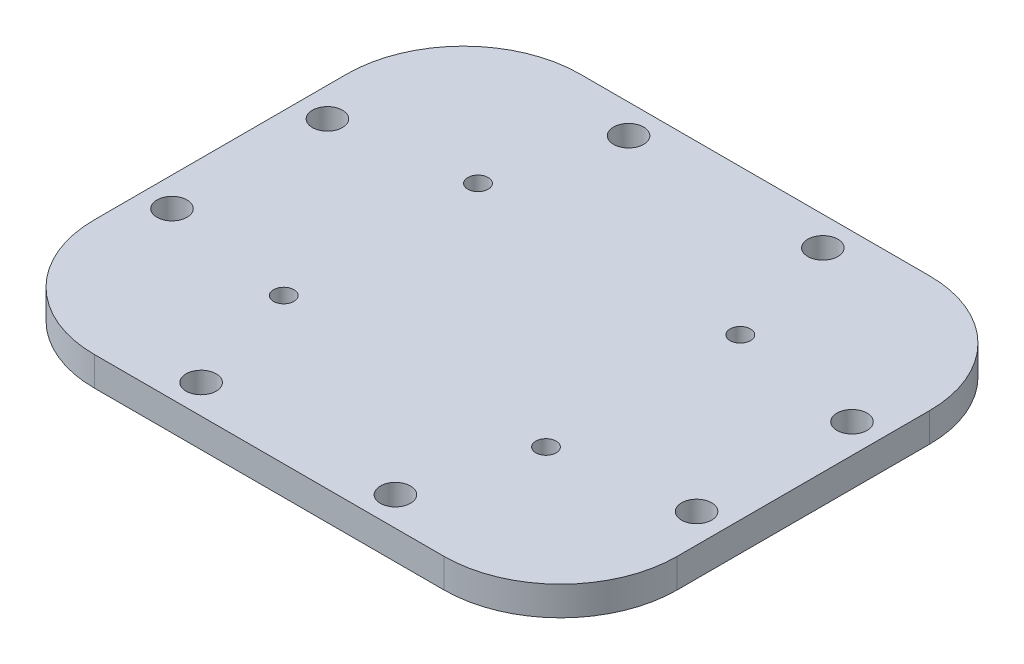
ISO-10303-21;
HEADER;
FILE_DESCRIPTION(('STEP AP214'),'2;1');
FILE_NAME('part.step','',(''),(''),'','','');
FILE_SCHEMA(('AUTOMOTIVE_DESIGN { 1 0 10303 214 1 1 1 1 }'));
ENDSEC;
DATA;
#1=APPLICATION_CONTEXT('core data for automotive mechanical design processes');
#2=APPLICATION_PROTOCOL_DEFINITION('international standard','automotive_design',2000,#1);
#3=PRODUCT_CONTEXT('',#1,'mechanical');
#4=PRODUCT('Part','Part','',(#3));
#5=PRODUCT_RELATED_PRODUCT_CATEGORY('part','',(#4));
#6=PRODUCT_DEFINITION_FORMATION('','',#4);
#7=PRODUCT_DEFINITION_CONTEXT('part definition',#1,'design');
#8=PRODUCT_DEFINITION('design','',#6,#7);
#9=PRODUCT_DEFINITION_SHAPE('','',#8);
#10=(LENGTH_UNIT() NAMED_UNIT(*) SI_UNIT(.MILLI.,.METRE.));
#11=(NAMED_UNIT(*) PLANE_ANGLE_UNIT() SI_UNIT($,.RADIAN.));
#12=(NAMED_UNIT(*) SI_UNIT($,.STERADIAN.) SOLID_ANGLE_UNIT());
#13=UNCERTAINTY_MEASURE_WITH_UNIT(LENGTH_MEASURE(1.E-05),#10,'distance_accuracy_value','');
#14=(GEOMETRIC_REPRESENTATION_CONTEXT(3) GLOBAL_UNCERTAINTY_ASSIGNED_CONTEXT((#13)) GLOBAL_UNIT_ASSIGNED_CONTEXT((#10,
#11,#12)) REPRESENTATION_CONTEXT('',''));
#15=CARTESIAN_POINT('',(0.,0.,0.));
#16=DIRECTION('',(0.,0.,1.));
#17=DIRECTION('',(1.,0.,0.));
#18=AXIS2_PLACEMENT_3D('',#15,#16,#17);
#19=CARTESIAN_POINT('',(30.,3.,-25.));
#20=DIRECTION('',(-1.,0.,0.));
#21=DIRECTION('',(0.,0.,1.));
#22=AXIS2_PLACEMENT_3D('',#19,#20,#21);
#23=PLANE('',#22);
#24=DIRECTION('',(0.,0.,-1.));
#25=VECTOR('',#24,1.);
#26=CARTESIAN_POINT('',(30.,3.,-25.));
#27=LINE('',#26,#25);
#28=CARTESIAN_POINT('',(30.,3.,13.));
#29=VERTEX_POINT('',#28);
#30=CARTESIAN_POINT('',(30.,3.,-13.));
#31=VERTEX_POINT('',#30);
#32=EDGE_CURVE('E124',#29,#31,#27,.T.);
#33=ORIENTED_EDGE('',*,*,#32,.F.);
#34=DIRECTION('',(0.,-1.,0.));
#35=VECTOR('',#34,1.);
#36=CARTESIAN_POINT('',(30.,3.,13.));
#37=LINE('',#36,#35);
#38=CARTESIAN_POINT('',(30.,0.,13.));
#39=VERTEX_POINT('',#38);
#40=EDGE_CURVE('E109',#29,#39,#37,.T.);
#41=ORIENTED_EDGE('',*,*,#40,.T.);
#42=DIRECTION('',(0.,0.,-1.));
#43=VECTOR('',#42,1.);
#44=CARTESIAN_POINT('',(30.,0.,-25.));
#45=LINE('',#44,#43);
#46=CARTESIAN_POINT('',(30.,0.,-13.));
#47=VERTEX_POINT('',#46);
#48=EDGE_CURVE('E121',#39,#47,#45,.T.);
#49=ORIENTED_EDGE('',*,*,#48,.T.);
#50=DIRECTION('',(0.,-1.,0.));
#51=VECTOR('',#50,1.);
#52=CARTESIAN_POINT('',(30.,3.,-13.));
#53=LINE('',#52,#51);
#54=EDGE_CURVE('E126',#47,#31,#53,.F.);
#55=ORIENTED_EDGE('',*,*,#54,.T.);
#56=EDGE_LOOP('',(#33,#41,#49,#55));
#57=FACE_BOUND('',#56,.T.);
#58=ADVANCED_FACE('F39',(#57),#23,.F.);
#59=CARTESIAN_POINT('',(-30.,3.,-25.));
#60=DIRECTION('',(0.,0.,1.));
#61=DIRECTION('',(1.,0.,0.));
#62=AXIS2_PLACEMENT_3D('',#59,#60,#61);
#63=PLANE('',#62);
#64=DIRECTION('',(-1.,0.,0.));
#65=VECTOR('',#64,1.);
#66=CARTESIAN_POINT('',(-30.,0.,-25.));
#67=LINE('',#66,#65);
#68=CARTESIAN_POINT('',(18.,0.,-25.));
#69=VERTEX_POINT('',#68);
#70=CARTESIAN_POINT('',(-18.,0.,-25.));
#71=VERTEX_POINT('',#70);
#72=EDGE_CURVE('E131',#69,#71,#67,.T.);
#73=ORIENTED_EDGE('',*,*,#72,.T.);
#74=DIRECTION('',(0.,-1.,0.));
#75=VECTOR('',#74,1.);
#76=CARTESIAN_POINT('',(-18.,3.,-25.));
#77=LINE('',#76,#75);
#78=CARTESIAN_POINT('',(-18.,3.,-25.));
#79=VERTEX_POINT('',#78);
#80=EDGE_CURVE('E12',#71,#79,#77,.F.);
#81=ORIENTED_EDGE('',*,*,#80,.T.);
#82=DIRECTION('',(-1.,0.,0.));
#83=VECTOR('',#82,1.);
#84=CARTESIAN_POINT('',(-30.,3.,-25.));
#85=LINE('',#84,#83);
#86=CARTESIAN_POINT('',(18.,3.,-25.));
#87=VERTEX_POINT('',#86);
#88=EDGE_CURVE('E194',#87,#79,#85,.T.);
#89=ORIENTED_EDGE('',*,*,#88,.F.);
#90=DIRECTION('',(0.,-1.,0.));
#91=VECTOR('',#90,1.);
#92=CARTESIAN_POINT('',(18.,3.,-25.));
#93=LINE('',#92,#91);
#94=EDGE_CURVE('E47',#87,#69,#93,.T.);
#95=ORIENTED_EDGE('',*,*,#94,.T.);
#96=EDGE_LOOP('',(#73,#81,#89,#95));
#97=FACE_BOUND('',#96,.T.);
#98=ADVANCED_FACE('F192',(#97),#63,.F.);
#99=CARTESIAN_POINT('',(-30.,3.,-25.));
#100=DIRECTION('',(1.,0.,0.));
#101=DIRECTION('',(0.,0.,-1.));
#102=AXIS2_PLACEMENT_3D('',#99,#100,#101);
#103=PLANE('',#102);
#104=DIRECTION('',(0.,0.,1.));
#105=VECTOR('',#104,1.);
#106=CARTESIAN_POINT('',(-30.,3.,-25.));
#107=LINE('',#106,#105);
#108=CARTESIAN_POINT('',(-30.,3.,-13.));
#109=VERTEX_POINT('',#108);
#110=CARTESIAN_POINT('',(-30.,3.,13.));
#111=VERTEX_POINT('',#110);
#112=EDGE_CURVE('E202',#109,#111,#107,.T.);
#113=ORIENTED_EDGE('',*,*,#112,.F.);
#114=DIRECTION('',(0.,-1.,0.));
#115=VECTOR('',#114,1.);
#116=CARTESIAN_POINT('',(-30.,3.,-13.));
#117=LINE('',#116,#115);
#118=CARTESIAN_POINT('',(-30.,0.,-13.));
#119=VERTEX_POINT('',#118);
#120=EDGE_CURVE('E186',#109,#119,#117,.T.);
#121=ORIENTED_EDGE('',*,*,#120,.T.);
#122=DIRECTION('',(0.,0.,1.));
#123=VECTOR('',#122,1.);
#124=CARTESIAN_POINT('',(-30.,0.,-25.));
#125=LINE('',#124,#123);
#126=CARTESIAN_POINT('',(-30.,0.,13.));
#127=VERTEX_POINT('',#126);
#128=EDGE_CURVE('E135',#119,#127,#125,.T.);
#129=ORIENTED_EDGE('',*,*,#128,.T.);
#130=DIRECTION('',(0.,-1.,0.));
#131=VECTOR('',#130,1.);
#132=CARTESIAN_POINT('',(-30.,3.,13.));
#133=LINE('',#132,#131);
#134=EDGE_CURVE('E54',#127,#111,#133,.F.);
#135=ORIENTED_EDGE('',*,*,#134,.T.);
#136=EDGE_LOOP('',(#113,#121,#129,#135));
#137=FACE_BOUND('',#136,.T.);
#138=ADVANCED_FACE('F201',(#137),#103,.F.);
#139=CARTESIAN_POINT('',(-30.,3.,25.));
#140=DIRECTION('',(0.,0.,-1.));
#141=DIRECTION('',(-1.,0.,0.));
#142=AXIS2_PLACEMENT_3D('',#139,#140,#141);
#143=PLANE('',#142);
#144=DIRECTION('',(1.,0.,0.));
#145=VECTOR('',#144,1.);
#146=CARTESIAN_POINT('',(-30.,0.,25.));
#147=LINE('',#146,#145);
#148=CARTESIAN_POINT('',(-18.,0.,25.));
#149=VERTEX_POINT('',#148);
#150=CARTESIAN_POINT('',(18.,0.,25.));
#151=VERTEX_POINT('',#150);
#152=EDGE_CURVE('E151',#149,#151,#147,.T.);
#153=ORIENTED_EDGE('',*,*,#152,.T.);
#154=DIRECTION('',(0.,-1.,0.));
#155=VECTOR('',#154,1.);
#156=CARTESIAN_POINT('',(18.,3.,25.));
#157=LINE('',#156,#155);
#158=CARTESIAN_POINT('',(18.,3.,25.));
#159=VERTEX_POINT('',#158);
#160=EDGE_CURVE('E110',#151,#159,#157,.F.);
#161=ORIENTED_EDGE('',*,*,#160,.T.);
#162=DIRECTION('',(1.,0.,0.));
#163=VECTOR('',#162,1.);
#164=CARTESIAN_POINT('',(-30.,3.,25.));
#165=LINE('',#164,#163);
#166=CARTESIAN_POINT('',(-18.,3.,25.));
#167=VERTEX_POINT('',#166);
#168=EDGE_CURVE('E141',#167,#159,#165,.T.);
#169=ORIENTED_EDGE('',*,*,#168,.F.);
#170=DIRECTION('',(0.,-1.,0.));
#171=VECTOR('',#170,1.);
#172=CARTESIAN_POINT('',(-18.,3.,25.));
#173=LINE('',#172,#171);
#174=EDGE_CURVE('E115',#167,#149,#173,.T.);
#175=ORIENTED_EDGE('',*,*,#174,.T.);
#176=EDGE_LOOP('',(#153,#161,#169,#175));
#177=FACE_BOUND('',#176,.T.);
#178=ADVANCED_FACE('F343',(#177),#143,.F.);
#179=CARTESIAN_POINT('',(0.,3.,0.));
#180=DIRECTION('',(0.,1.,0.));
#181=DIRECTION('',(0.,0.,1.));
#182=AXIS2_PLACEMENT_3D('',#179,#180,#181);
#183=PLANE('',#182);
#184=CARTESIAN_POINT('',(10.,3.,22.));
#185=DIRECTION('',(0.,1.,0.));
#186=DIRECTION('',(0.,0.,1.));
#187=AXIS2_PLACEMENT_3D('',#184,#185,#186);
#188=CIRCLE('',#187,1.55);
#189=CARTESIAN_POINT('',(10.,3.,23.55));
#190=VERTEX_POINT('',#189);
#191=EDGE_CURVE('E215',#190,#190,#188,.T.);
#192=ORIENTED_EDGE('',*,*,#191,.F.);
#193=EDGE_LOOP('',(#192));
#194=FACE_BOUND('',#193,.T.);
#195=CARTESIAN_POINT('',(-10.,3.,22.));
#196=DIRECTION('',(0.,1.,0.));
#197=DIRECTION('',(0.,0.,1.));
#198=AXIS2_PLACEMENT_3D('',#195,#196,#197);
#199=CIRCLE('',#198,1.55);
#200=CARTESIAN_POINT('',(-10.,3.,23.55));
#201=VERTEX_POINT('',#200);
#202=EDGE_CURVE('E222',#201,#201,#199,.T.);
#203=ORIENTED_EDGE('',*,*,#202,.F.);
#204=EDGE_LOOP('',(#203));
#205=FACE_BOUND('',#204,.T.);
#206=CARTESIAN_POINT('',(-27.,3.,8.));
#207=DIRECTION('',(0.,1.,0.));
#208=DIRECTION('',(0.,0.,1.));
#209=AXIS2_PLACEMENT_3D('',#206,#207,#208);
#210=CIRCLE('',#209,1.55);
#211=CARTESIAN_POINT('',(-27.,3.,9.55));
#212=VERTEX_POINT('',#211);
#213=EDGE_CURVE('E225',#212,#212,#210,.T.);
#214=ORIENTED_EDGE('',*,*,#213,.F.);
#215=EDGE_LOOP('',(#214));
#216=FACE_BOUND('',#215,.T.);
#217=CARTESIAN_POINT('',(-27.,3.,-8.));
#218=DIRECTION('',(0.,1.,0.));
#219=DIRECTION('',(0.,0.,1.));
#220=AXIS2_PLACEMENT_3D('',#217,#218,#219);
#221=CIRCLE('',#220,1.55);
#222=CARTESIAN_POINT('',(-27.,3.,-6.45));
#223=VERTEX_POINT('',#222);
#224=EDGE_CURVE('E228',#223,#223,#221,.T.);
#225=ORIENTED_EDGE('',*,*,#224,.F.);
#226=EDGE_LOOP('',(#225));
#227=FACE_BOUND('',#226,.T.);
#228=CARTESIAN_POINT('',(-10.,3.,-22.));
#229=DIRECTION('',(0.,1.,0.));
#230=DIRECTION('',(0.,0.,1.));
#231=AXIS2_PLACEMENT_3D('',#228,#229,#230);
#232=CIRCLE('',#231,1.55);
#233=CARTESIAN_POINT('',(-10.,3.,-20.45));
#234=VERTEX_POINT('',#233);
#235=EDGE_CURVE('E231',#234,#234,#232,.T.);
#236=ORIENTED_EDGE('',*,*,#235,.F.);
#237=EDGE_LOOP('',(#236));
#238=FACE_BOUND('',#237,.T.);
#239=CARTESIAN_POINT('',(10.,3.,-22.));
#240=DIRECTION('',(0.,1.,0.));
#241=DIRECTION('',(0.,0.,1.));
#242=AXIS2_PLACEMENT_3D('',#239,#240,#241);
#243=CIRCLE('',#242,1.55);
#244=CARTESIAN_POINT('',(10.,3.,-20.45));
#245=VERTEX_POINT('',#244);
#246=EDGE_CURVE('E234',#245,#245,#243,.T.);
#247=ORIENTED_EDGE('',*,*,#246,.F.);
#248=EDGE_LOOP('',(#247));
#249=FACE_BOUND('',#248,.T.);
#250=CARTESIAN_POINT('',(27.,3.,-8.));
#251=DIRECTION('',(0.,1.,0.));
#252=DIRECTION('',(0.,0.,1.));
#253=AXIS2_PLACEMENT_3D('',#250,#251,#252);
#254=CIRCLE('',#253,1.55);
#255=CARTESIAN_POINT('',(27.,3.,-6.45));
#256=VERTEX_POINT('',#255);
#257=EDGE_CURVE('E237',#256,#256,#254,.T.);
#258=ORIENTED_EDGE('',*,*,#257,.F.);
#259=EDGE_LOOP('',(#258));
#260=FACE_BOUND('',#259,.T.);
#261=CARTESIAN_POINT('',(27.,3.,8.));
#262=DIRECTION('',(0.,1.,0.));
#263=DIRECTION('',(0.,0.,1.));
#264=AXIS2_PLACEMENT_3D('',#261,#262,#263);
#265=CIRCLE('',#264,1.55);
#266=CARTESIAN_POINT('',(27.,3.,9.55));
#267=VERTEX_POINT('',#266);
#268=EDGE_CURVE('E240',#267,#267,#265,.T.);
#269=ORIENTED_EDGE('',*,*,#268,.F.);
#270=EDGE_LOOP('',(#269));
#271=FACE_BOUND('',#270,.T.);
#272=CARTESIAN_POINT('',(13.5,3.,10.));
#273=DIRECTION('',(0.,1.,0.));
#274=DIRECTION('',(0.,0.,-1.));
#275=AXIS2_PLACEMENT_3D('',#272,#273,#274);
#276=CIRCLE('',#275,1.05);
#277=CARTESIAN_POINT('',(13.5,3.,8.95));
#278=VERTEX_POINT('',#277);
#279=EDGE_CURVE('E211',#278,#278,#276,.T.);
#280=ORIENTED_EDGE('',*,*,#279,.F.);
#281=EDGE_LOOP('',(#280));
#282=FACE_BOUND('',#281,.T.);
#283=CARTESIAN_POINT('',(-13.5,3.,10.));
#284=DIRECTION('',(0.,1.,0.));
#285=DIRECTION('',(0.,0.,1.));
#286=AXIS2_PLACEMENT_3D('',#283,#284,#285);
#287=CIRCLE('',#286,1.05);
#288=CARTESIAN_POINT('',(-13.5,3.,11.05));
#289=VERTEX_POINT('',#288);
#290=EDGE_CURVE('E214',#289,#289,#287,.T.);
#291=ORIENTED_EDGE('',*,*,#290,.F.);
#292=EDGE_LOOP('',(#291));
#293=FACE_BOUND('',#292,.T.);
#294=CARTESIAN_POINT('',(-13.5,3.,-10.));
#295=DIRECTION('',(0.,1.,0.));
#296=DIRECTION('',(0.,0.,-1.));
#297=AXIS2_PLACEMENT_3D('',#294,#295,#296);
#298=CIRCLE('',#297,1.05);
#299=CARTESIAN_POINT('',(-13.5,3.,-11.05));
#300=VERTEX_POINT('',#299);
#301=EDGE_CURVE('E210',#300,#300,#298,.T.);
#302=ORIENTED_EDGE('',*,*,#301,.F.);
#303=EDGE_LOOP('',(#302));
#304=FACE_BOUND('',#303,.T.);
#305=CARTESIAN_POINT('',(13.5,3.,-10.));
#306=DIRECTION('',(0.,1.,0.));
#307=DIRECTION('',(0.,0.,1.));
#308=AXIS2_PLACEMENT_3D('',#305,#306,#307);
#309=CIRCLE('',#308,1.05);
#310=CARTESIAN_POINT('',(13.5,3.,-8.95));
#311=VERTEX_POINT('',#310);
#312=EDGE_CURVE('E159',#311,#311,#309,.T.);
#313=ORIENTED_EDGE('',*,*,#312,.F.);
#314=EDGE_LOOP('',(#313));
#315=FACE_BOUND('',#314,.T.);
#316=ORIENTED_EDGE('',*,*,#168,.T.);
#317=CARTESIAN_POINT('',(18.,3.,13.));
#318=DIRECTION('',(0.,1.,0.));
#319=DIRECTION('',(0.,0.,1.));
#320=AXIS2_PLACEMENT_3D('',#317,#318,#319);
#321=CIRCLE('',#320,12.);
#322=EDGE_CURVE('E183',#159,#29,#321,.T.);
#323=ORIENTED_EDGE('',*,*,#322,.T.);
#324=ORIENTED_EDGE('',*,*,#32,.T.);
#325=CARTESIAN_POINT('',(18.,3.,-13.));
#326=DIRECTION('',(0.,1.,0.));
#327=DIRECTION('',(0.,0.,1.));
#328=AXIS2_PLACEMENT_3D('',#325,#326,#327);
#329=CIRCLE('',#328,12.);
#330=EDGE_CURVE('E180',#31,#87,#329,.T.);
#331=ORIENTED_EDGE('',*,*,#330,.T.);
#332=ORIENTED_EDGE('',*,*,#88,.T.);
#333=CARTESIAN_POINT('',(-18.,3.,-13.));
#334=DIRECTION('',(0.,1.,0.));
#335=DIRECTION('',(0.,0.,1.));
#336=AXIS2_PLACEMENT_3D('',#333,#334,#335);
#337=CIRCLE('',#336,12.);
#338=EDGE_CURVE('E61',#79,#109,#337,.T.);
#339=ORIENTED_EDGE('',*,*,#338,.T.);
#340=ORIENTED_EDGE('',*,*,#112,.T.);
#341=CARTESIAN_POINT('',(-18.,3.,13.));
#342=DIRECTION('',(0.,1.,0.));
#343=DIRECTION('',(0.,0.,1.));
#344=AXIS2_PLACEMENT_3D('',#341,#342,#343);
#345=CIRCLE('',#344,12.);
#346=EDGE_CURVE('E178',#111,#167,#345,.T.);
#347=ORIENTED_EDGE('',*,*,#346,.T.);
#348=EDGE_LOOP('',(#316,#323,#324,#331,#332,#339,#340,#347));
#349=FACE_BOUND('',#348,.T.);
#350=ADVANCED_FACE('F288',(#194,#205,#216,#227,#238,#249,#260,#271,#282,#293,#304,#315,#349),
#183,.T.);
#351=CARTESIAN_POINT('',(0.,0.,0.));
#352=DIRECTION('',(0.,1.,0.));
#353=DIRECTION('',(0.,0.,1.));
#354=AXIS2_PLACEMENT_3D('',#351,#352,#353);
#355=PLANE('',#354);
#356=CARTESIAN_POINT('',(10.,0.,22.));
#357=DIRECTION('',(0.,-1.,0.));
#358=DIRECTION('',(0.,0.,-1.));
#359=AXIS2_PLACEMENT_3D('',#356,#357,#358);
#360=CIRCLE('',#359,1.55);
#361=CARTESIAN_POINT('',(10.,0.,20.45));
#362=VERTEX_POINT('',#361);
#363=EDGE_CURVE('E246',#362,#362,#360,.T.);
#364=ORIENTED_EDGE('',*,*,#363,.F.);
#365=EDGE_LOOP('',(#364));
#366=FACE_BOUND('',#365,.T.);
#367=CARTESIAN_POINT('',(-10.,0.,22.));
#368=DIRECTION('',(0.,-1.,0.));
#369=DIRECTION('',(0.,0.,1.));
#370=AXIS2_PLACEMENT_3D('',#367,#368,#369);
#371=CIRCLE('',#370,1.55);
#372=CARTESIAN_POINT('',(-10.,0.,23.55));
#373=VERTEX_POINT('',#372);
#374=EDGE_CURVE('E274',#373,#373,#371,.T.);
#375=ORIENTED_EDGE('',*,*,#374,.F.);
#376=EDGE_LOOP('',(#375));
#377=FACE_BOUND('',#376,.T.);
#378=CARTESIAN_POINT('',(-27.,0.,8.));
#379=DIRECTION('',(0.,-1.,0.));
#380=DIRECTION('',(0.,0.,1.));
#381=AXIS2_PLACEMENT_3D('',#378,#379,#380);
#382=CIRCLE('',#381,1.55);
#383=CARTESIAN_POINT('',(-27.,0.,9.55));
#384=VERTEX_POINT('',#383);
#385=EDGE_CURVE('E251',#384,#384,#382,.T.);
#386=ORIENTED_EDGE('',*,*,#385,.F.);
#387=EDGE_LOOP('',(#386));
#388=FACE_BOUND('',#387,.T.);
#389=CARTESIAN_POINT('',(-27.,0.,-8.));
#390=DIRECTION('',(0.,-1.,0.));
#391=DIRECTION('',(0.,0.,-1.));
#392=AXIS2_PLACEMENT_3D('',#389,#390,#391);
#393=CIRCLE('',#392,1.55);
#394=CARTESIAN_POINT('',(-27.,0.,-9.55));
#395=VERTEX_POINT('',#394);
#396=EDGE_CURVE('E247',#395,#395,#393,.T.);
#397=ORIENTED_EDGE('',*,*,#396,.F.);
#398=EDGE_LOOP('',(#397));
#399=FACE_BOUND('',#398,.T.);
#400=CARTESIAN_POINT('',(-10.,0.,-22.));
#401=DIRECTION('',(0.,-1.,0.));
#402=DIRECTION('',(0.,0.,-1.));
#403=AXIS2_PLACEMENT_3D('',#400,#401,#402);
#404=CIRCLE('',#403,1.55);
#405=CARTESIAN_POINT('',(-10.,0.,-23.55));
#406=VERTEX_POINT('',#405);
#407=EDGE_CURVE('E252',#406,#406,#404,.T.);
#408=ORIENTED_EDGE('',*,*,#407,.F.);
#409=EDGE_LOOP('',(#408));
#410=FACE_BOUND('',#409,.T.);
#411=CARTESIAN_POINT('',(10.,0.,-22.));
#412=DIRECTION('',(0.,-1.,0.));
#413=DIRECTION('',(0.,0.,1.));
#414=AXIS2_PLACEMENT_3D('',#411,#412,#413);
#415=CIRCLE('',#414,1.55);
#416=CARTESIAN_POINT('',(10.,0.,-20.45));
#417=VERTEX_POINT('',#416);
#418=EDGE_CURVE('E264',#417,#417,#415,.T.);
#419=ORIENTED_EDGE('',*,*,#418,.F.);
#420=EDGE_LOOP('',(#419));
#421=FACE_BOUND('',#420,.T.);
#422=CARTESIAN_POINT('',(27.,0.,-8.));
#423=DIRECTION('',(0.,-1.,0.));
#424=DIRECTION('',(0.,0.,1.));
#425=AXIS2_PLACEMENT_3D('',#422,#423,#424);
#426=CIRCLE('',#425,1.55);
#427=CARTESIAN_POINT('',(27.,0.,-6.45));
#428=VERTEX_POINT('',#427);
#429=EDGE_CURVE('E268',#428,#428,#426,.T.);
#430=ORIENTED_EDGE('',*,*,#429,.F.);
#431=EDGE_LOOP('',(#430));
#432=FACE_BOUND('',#431,.T.);
#433=CARTESIAN_POINT('',(27.,0.,8.));
#434=DIRECTION('',(0.,-1.,0.));
#435=DIRECTION('',(0.,0.,-1.));
#436=AXIS2_PLACEMENT_3D('',#433,#434,#435);
#437=CIRCLE('',#436,1.55);
#438=CARTESIAN_POINT('',(27.,0.,6.45));
#439=VERTEX_POINT('',#438);
#440=EDGE_CURVE('E242',#439,#439,#437,.T.);
#441=ORIENTED_EDGE('',*,*,#440,.F.);
#442=EDGE_LOOP('',(#441));
#443=FACE_BOUND('',#442,.T.);
#444=CARTESIAN_POINT('',(13.5,0.,10.));
#445=DIRECTION('',(0.,1.,0.));
#446=DIRECTION('',(0.,0.,1.));
#447=AXIS2_PLACEMENT_3D('',#444,#445,#446);
#448=CIRCLE('',#447,1.05);
#449=CARTESIAN_POINT('',(13.5,0.,11.05));
#450=VERTEX_POINT('',#449);
#451=EDGE_CURVE('E132',#450,#450,#448,.T.);
#452=ORIENTED_EDGE('',*,*,#451,.T.);
#453=EDGE_LOOP('',(#452));
#454=FACE_BOUND('',#453,.T.);
#455=CARTESIAN_POINT('',(-13.5,0.,10.));
#456=DIRECTION('',(0.,1.,0.));
#457=DIRECTION('',(0.,0.,1.));
#458=AXIS2_PLACEMENT_3D('',#455,#456,#457);
#459=CIRCLE('',#458,1.05);
#460=CARTESIAN_POINT('',(-13.5,0.,11.05));
#461=VERTEX_POINT('',#460);
#462=EDGE_CURVE('E137',#461,#461,#459,.T.);
#463=ORIENTED_EDGE('',*,*,#462,.T.);
#464=EDGE_LOOP('',(#463));
#465=FACE_BOUND('',#464,.T.);
#466=CARTESIAN_POINT('',(-13.5,0.,-10.));
#467=DIRECTION('',(0.,1.,0.));
#468=DIRECTION('',(0.,0.,1.));
#469=AXIS2_PLACEMENT_3D('',#466,#467,#468);
#470=CIRCLE('',#469,1.05);
#471=CARTESIAN_POINT('',(-13.5,0.,-8.95));
#472=VERTEX_POINT('',#471);
#473=EDGE_CURVE('E158',#472,#472,#470,.T.);
#474=ORIENTED_EDGE('',*,*,#473,.T.);
#475=EDGE_LOOP('',(#474));
#476=FACE_BOUND('',#475,.T.);
#477=CARTESIAN_POINT('',(13.5,0.,-10.));
#478=DIRECTION('',(0.,1.,0.));
#479=DIRECTION('',(0.,0.,1.));
#480=AXIS2_PLACEMENT_3D('',#477,#478,#479);
#481=CIRCLE('',#480,1.05);
#482=CARTESIAN_POINT('',(13.5,0.,-8.95));
#483=VERTEX_POINT('',#482);
#484=EDGE_CURVE('E154',#483,#483,#481,.T.);
#485=ORIENTED_EDGE('',*,*,#484,.T.);
#486=EDGE_LOOP('',(#485));
#487=FACE_BOUND('',#486,.T.);
#488=ORIENTED_EDGE('',*,*,#48,.F.);
#489=CARTESIAN_POINT('',(18.,0.,13.));
#490=DIRECTION('',(0.,1.,0.));
#491=DIRECTION('',(0.,0.,1.));
#492=AXIS2_PLACEMENT_3D('',#489,#490,#491);
#493=CIRCLE('',#492,12.);
#494=EDGE_CURVE('E105',#39,#151,#493,.F.);
#495=ORIENTED_EDGE('',*,*,#494,.T.);
#496=ORIENTED_EDGE('',*,*,#152,.F.);
#497=CARTESIAN_POINT('',(-18.,0.,13.));
#498=DIRECTION('',(0.,1.,0.));
#499=DIRECTION('',(0.,0.,1.));
#500=AXIS2_PLACEMENT_3D('',#497,#498,#499);
#501=CIRCLE('',#500,12.);
#502=EDGE_CURVE('E125',#149,#127,#501,.F.);
#503=ORIENTED_EDGE('',*,*,#502,.T.);
#504=ORIENTED_EDGE('',*,*,#128,.F.);
#505=CARTESIAN_POINT('',(-18.,0.,-13.));
#506=DIRECTION('',(0.,1.,0.));
#507=DIRECTION('',(0.,0.,1.));
#508=AXIS2_PLACEMENT_3D('',#505,#506,#507);
#509=CIRCLE('',#508,12.);
#510=EDGE_CURVE('E116',#119,#71,#509,.F.);
#511=ORIENTED_EDGE('',*,*,#510,.T.);
#512=ORIENTED_EDGE('',*,*,#72,.F.);
#513=CARTESIAN_POINT('',(18.,0.,-13.));
#514=DIRECTION('',(0.,1.,0.));
#515=DIRECTION('',(0.,0.,1.));
#516=AXIS2_PLACEMENT_3D('',#513,#514,#515);
#517=CIRCLE('',#516,12.);
#518=EDGE_CURVE('E130',#69,#47,#517,.F.);
#519=ORIENTED_EDGE('',*,*,#518,.T.);
#520=EDGE_LOOP('',(#488,#495,#496,#503,#504,#511,#512,#519));
#521=FACE_BOUND('',#520,.T.);
#522=ADVANCED_FACE('F128',(#366,#377,#388,#399,#410,#421,#432,#443,#454,#465,#476,#487,#521),
#355,.F.);
#523=CARTESIAN_POINT('',(13.5,-7.,-10.));
#524=DIRECTION('',(0.,1.,0.));
#525=DIRECTION('',(0.,0.,1.));
#526=AXIS2_PLACEMENT_3D('',#523,#524,#525);
#527=CYLINDRICAL_SURFACE('',#526,1.05);
#528=ORIENTED_EDGE('',*,*,#312,.T.);
#529=EDGE_LOOP('',(#528));
#530=FACE_BOUND('',#529,.T.);
#531=ORIENTED_EDGE('',*,*,#484,.F.);
#532=EDGE_LOOP('',(#531));
#533=FACE_BOUND('',#532,.T.);
#534=ADVANCED_FACE('F287',(#530,#533),#527,.F.);
#535=CARTESIAN_POINT('',(-13.5,-7.,-10.));
#536=DIRECTION('',(0.,1.,0.));
#537=DIRECTION('',(0.,0.,1.));
#538=AXIS2_PLACEMENT_3D('',#535,#536,#537);
#539=CYLINDRICAL_SURFACE('',#538,1.05);
#540=ORIENTED_EDGE('',*,*,#301,.T.);
#541=EDGE_LOOP('',(#540));
#542=FACE_BOUND('',#541,.T.);
#543=ORIENTED_EDGE('',*,*,#473,.F.);
#544=EDGE_LOOP('',(#543));
#545=FACE_BOUND('',#544,.T.);
#546=ADVANCED_FACE('F311',(#542,#545),#539,.F.);
#547=CARTESIAN_POINT('',(-13.5,-7.,10.));
#548=DIRECTION('',(0.,1.,0.));
#549=DIRECTION('',(0.,0.,1.));
#550=AXIS2_PLACEMENT_3D('',#547,#548,#549);
#551=CYLINDRICAL_SURFACE('',#550,1.05);
#552=ORIENTED_EDGE('',*,*,#290,.T.);
#553=EDGE_LOOP('',(#552));
#554=FACE_BOUND('',#553,.T.);
#555=ORIENTED_EDGE('',*,*,#462,.F.);
#556=EDGE_LOOP('',(#555));
#557=FACE_BOUND('',#556,.T.);
#558=ADVANCED_FACE('F317',(#554,#557),#551,.F.);
#559=CARTESIAN_POINT('',(13.5,-7.,10.));
#560=DIRECTION('',(0.,1.,0.));
#561=DIRECTION('',(0.,0.,1.));
#562=AXIS2_PLACEMENT_3D('',#559,#560,#561);
#563=CYLINDRICAL_SURFACE('',#562,1.05);
#564=ORIENTED_EDGE('',*,*,#279,.T.);
#565=EDGE_LOOP('',(#564));
#566=FACE_BOUND('',#565,.T.);
#567=ORIENTED_EDGE('',*,*,#451,.F.);
#568=EDGE_LOOP('',(#567));
#569=FACE_BOUND('',#568,.T.);
#570=ADVANCED_FACE('F440',(#566,#569),#563,.F.);
#571=CARTESIAN_POINT('',(27.,10.,8.));
#572=DIRECTION('',(0.,-1.,0.));
#573=DIRECTION('',(0.,0.,-1.));
#574=AXIS2_PLACEMENT_3D('',#571,#572,#573);
#575=CYLINDRICAL_SURFACE('',#574,1.55);
#576=ORIENTED_EDGE('',*,*,#268,.T.);
#577=EDGE_LOOP('',(#576));
#578=FACE_BOUND('',#577,.T.);
#579=ORIENTED_EDGE('',*,*,#440,.T.);
#580=EDGE_LOOP('',(#579));
#581=FACE_BOUND('',#580,.T.);
#582=ADVANCED_FACE('F430',(#578,#581),#575,.F.);
#583=CARTESIAN_POINT('',(27.,10.,-8.));
#584=DIRECTION('',(0.,-1.,0.));
#585=DIRECTION('',(0.,0.,-1.));
#586=AXIS2_PLACEMENT_3D('',#583,#584,#585);
#587=CYLINDRICAL_SURFACE('',#586,1.55);
#588=ORIENTED_EDGE('',*,*,#257,.T.);
#589=EDGE_LOOP('',(#588));
#590=FACE_BOUND('',#589,.T.);
#591=ORIENTED_EDGE('',*,*,#429,.T.);
#592=EDGE_LOOP('',(#591));
#593=FACE_BOUND('',#592,.T.);
#594=ADVANCED_FACE('F420',(#590,#593),#587,.F.);
#595=CARTESIAN_POINT('',(10.,10.,-22.));
#596=DIRECTION('',(0.,-1.,0.));
#597=DIRECTION('',(0.,0.,-1.));
#598=AXIS2_PLACEMENT_3D('',#595,#596,#597);
#599=CYLINDRICAL_SURFACE('',#598,1.55);
#600=ORIENTED_EDGE('',*,*,#246,.T.);
#601=EDGE_LOOP('',(#600));
#602=FACE_BOUND('',#601,.T.);
#603=ORIENTED_EDGE('',*,*,#418,.T.);
#604=EDGE_LOOP('',(#603));
#605=FACE_BOUND('',#604,.T.);
#606=ADVANCED_FACE('F410',(#602,#605),#599,.F.);
#607=CARTESIAN_POINT('',(-10.,10.,-22.));
#608=DIRECTION('',(0.,-1.,0.));
#609=DIRECTION('',(0.,0.,-1.));
#610=AXIS2_PLACEMENT_3D('',#607,#608,#609);
#611=CYLINDRICAL_SURFACE('',#610,1.55);
#612=ORIENTED_EDGE('',*,*,#235,.T.);
#613=EDGE_LOOP('',(#612));
#614=FACE_BOUND('',#613,.T.);
#615=ORIENTED_EDGE('',*,*,#407,.T.);
#616=EDGE_LOOP('',(#615));
#617=FACE_BOUND('',#616,.T.);
#618=ADVANCED_FACE('F400',(#614,#617),#611,.F.);
#619=CARTESIAN_POINT('',(-27.,10.,-8.));
#620=DIRECTION('',(0.,-1.,0.));
#621=DIRECTION('',(0.,0.,-1.));
#622=AXIS2_PLACEMENT_3D('',#619,#620,#621);
#623=CYLINDRICAL_SURFACE('',#622,1.55);
#624=ORIENTED_EDGE('',*,*,#224,.T.);
#625=EDGE_LOOP('',(#624));
#626=FACE_BOUND('',#625,.T.);
#627=ORIENTED_EDGE('',*,*,#396,.T.);
#628=EDGE_LOOP('',(#627));
#629=FACE_BOUND('',#628,.T.);
#630=ADVANCED_FACE('F390',(#626,#629),#623,.F.);
#631=CARTESIAN_POINT('',(-27.,10.,8.));
#632=DIRECTION('',(0.,-1.,0.));
#633=DIRECTION('',(0.,0.,-1.));
#634=AXIS2_PLACEMENT_3D('',#631,#632,#633);
#635=CYLINDRICAL_SURFACE('',#634,1.55);
#636=ORIENTED_EDGE('',*,*,#213,.T.);
#637=EDGE_LOOP('',(#636));
#638=FACE_BOUND('',#637,.T.);
#639=ORIENTED_EDGE('',*,*,#385,.T.);
#640=EDGE_LOOP('',(#639));
#641=FACE_BOUND('',#640,.T.);
#642=ADVANCED_FACE('F283',(#638,#641),#635,.F.);
#643=CARTESIAN_POINT('',(-10.,10.,22.));
#644=DIRECTION('',(0.,-1.,0.));
#645=DIRECTION('',(0.,0.,-1.));
#646=AXIS2_PLACEMENT_3D('',#643,#644,#645);
#647=CYLINDRICAL_SURFACE('',#646,1.55);
#648=ORIENTED_EDGE('',*,*,#202,.T.);
#649=EDGE_LOOP('',(#648));
#650=FACE_BOUND('',#649,.T.);
#651=ORIENTED_EDGE('',*,*,#374,.T.);
#652=EDGE_LOOP('',(#651));
#653=FACE_BOUND('',#652,.T.);
#654=ADVANCED_FACE('F370',(#650,#653),#647,.F.);
#655=CARTESIAN_POINT('',(10.,10.,22.));
#656=DIRECTION('',(0.,-1.,0.));
#657=DIRECTION('',(0.,0.,-1.));
#658=AXIS2_PLACEMENT_3D('',#655,#656,#657);
#659=CYLINDRICAL_SURFACE('',#658,1.55);
#660=ORIENTED_EDGE('',*,*,#191,.T.);
#661=EDGE_LOOP('',(#660));
#662=FACE_BOUND('',#661,.T.);
#663=ORIENTED_EDGE('',*,*,#363,.T.);
#664=EDGE_LOOP('',(#663));
#665=FACE_BOUND('',#664,.T.);
#666=ADVANCED_FACE('F332',(#662,#665),#659,.F.);
#667=CARTESIAN_POINT('',(18.,3.,13.));
#668=DIRECTION('',(0.,-1.,0.));
#669=DIRECTION('',(0.,0.,-1.));
#670=AXIS2_PLACEMENT_3D('',#667,#668,#669);
#671=CYLINDRICAL_SURFACE('',#670,12.);
#672=ORIENTED_EDGE('',*,*,#322,.F.);
#673=ORIENTED_EDGE('',*,*,#160,.F.);
#674=ORIENTED_EDGE('',*,*,#494,.F.);
#675=ORIENTED_EDGE('',*,*,#40,.F.);
#676=EDGE_LOOP('',(#672,#673,#674,#675));
#677=FACE_BOUND('',#676,.T.);
#678=ADVANCED_FACE('F108',(#677),#671,.T.);
#679=CARTESIAN_POINT('',(-18.,3.,-13.));
#680=DIRECTION('',(0.,-1.,0.));
#681=DIRECTION('',(0.,0.,-1.));
#682=AXIS2_PLACEMENT_3D('',#679,#680,#681);
#683=CYLINDRICAL_SURFACE('',#682,12.);
#684=ORIENTED_EDGE('',*,*,#338,.F.);
#685=ORIENTED_EDGE('',*,*,#80,.F.);
#686=ORIENTED_EDGE('',*,*,#510,.F.);
#687=ORIENTED_EDGE('',*,*,#120,.F.);
#688=EDGE_LOOP('',(#684,#685,#686,#687));
#689=FACE_BOUND('',#688,.T.);
#690=ADVANCED_FACE('F200',(#689),#683,.T.);
#691=CARTESIAN_POINT('',(18.,3.,-13.));
#692=DIRECTION('',(0.,-1.,0.));
#693=DIRECTION('',(0.,0.,-1.));
#694=AXIS2_PLACEMENT_3D('',#691,#692,#693);
#695=CYLINDRICAL_SURFACE('',#694,12.);
#696=ORIENTED_EDGE('',*,*,#330,.F.);
#697=ORIENTED_EDGE('',*,*,#54,.F.);
#698=ORIENTED_EDGE('',*,*,#518,.F.);
#699=ORIENTED_EDGE('',*,*,#94,.F.);
#700=EDGE_LOOP('',(#696,#697,#698,#699));
#701=FACE_BOUND('',#700,.T.);
#702=ADVANCED_FACE('F334',(#701),#695,.T.);
#703=CARTESIAN_POINT('',(-18.,3.,13.));
#704=DIRECTION('',(0.,-1.,0.));
#705=DIRECTION('',(0.,0.,-1.));
#706=AXIS2_PLACEMENT_3D('',#703,#704,#705);
#707=CYLINDRICAL_SURFACE('',#706,12.);
#708=ORIENTED_EDGE('',*,*,#346,.F.);
#709=ORIENTED_EDGE('',*,*,#134,.F.);
#710=ORIENTED_EDGE('',*,*,#502,.F.);
#711=ORIENTED_EDGE('',*,*,#174,.F.);
#712=EDGE_LOOP('',(#708,#709,#710,#711));
#713=FACE_BOUND('',#712,.T.);
#714=ADVANCED_FACE('F41',(#713),#707,.T.);
#715=CLOSED_SHELL('',(#58,#98,#138,#178,#350,#522,#534,#546,#558,#570,#582,#594,#606,#618,#630,
#642,#654,#666,#678,#690,#702,#714));
#716=MANIFOLD_SOLID_BREP('B2',#715);
#717=ADVANCED_BREP_SHAPE_REPRESENTATION('',(#18,#716),#14);
#718=SHAPE_DEFINITION_REPRESENTATION(#9,#717);
ENDSEC;
END-ISO-10303-21;
